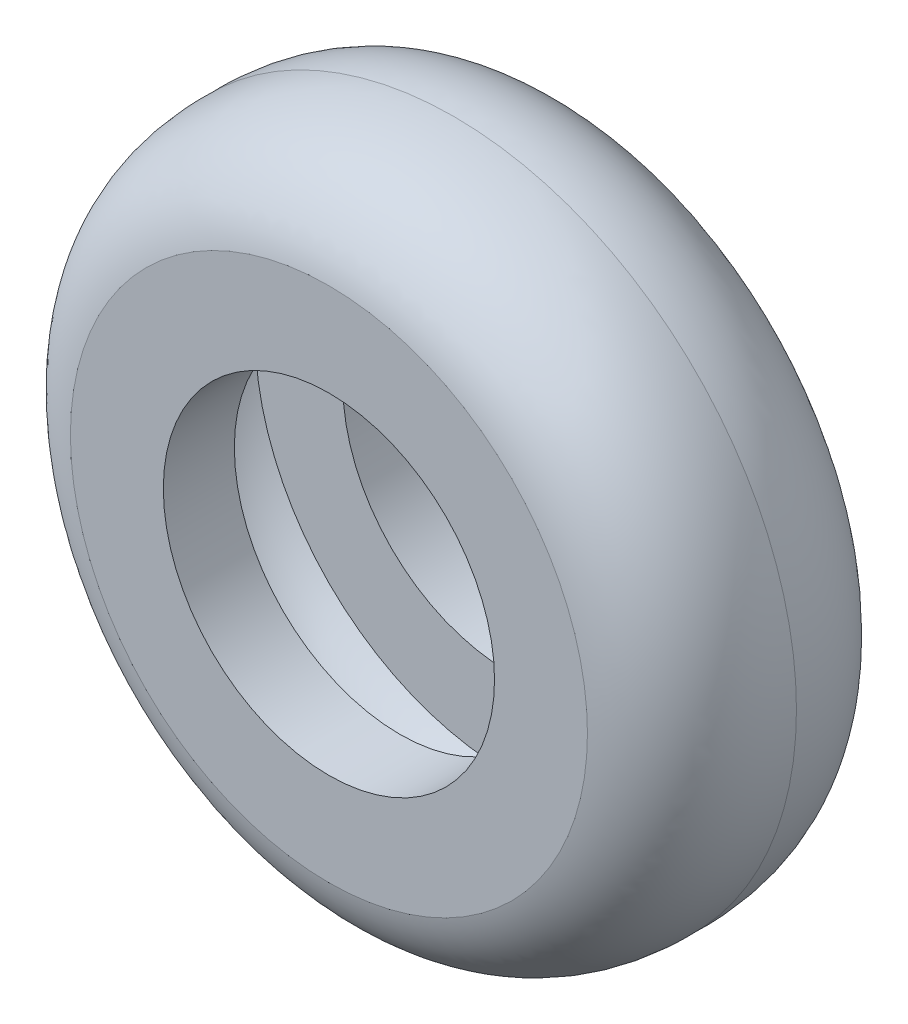
ISO-10303-21;
HEADER;
FILE_DESCRIPTION(('STEP AP214'),'2;1');
FILE_NAME('part.step','',(''),(''),'','','');
FILE_SCHEMA(('AUTOMOTIVE_DESIGN { 1 0 10303 214 1 1 1 1 }'));
ENDSEC;
DATA;
#1=APPLICATION_CONTEXT('core data for automotive mechanical design processes');
#2=APPLICATION_PROTOCOL_DEFINITION('international standard','automotive_design',2000,#1);
#3=PRODUCT_CONTEXT('',#1,'mechanical');
#4=PRODUCT('Part','Part','',(#3));
#5=PRODUCT_RELATED_PRODUCT_CATEGORY('part','',(#4));
#6=PRODUCT_DEFINITION_FORMATION('','',#4);
#7=PRODUCT_DEFINITION_CONTEXT('part definition',#1,'design');
#8=PRODUCT_DEFINITION('design','',#6,#7);
#9=PRODUCT_DEFINITION_SHAPE('','',#8);
#10=(LENGTH_UNIT() NAMED_UNIT(*) SI_UNIT(.MILLI.,.METRE.));
#11=(NAMED_UNIT(*) PLANE_ANGLE_UNIT() SI_UNIT($,.RADIAN.));
#12=(NAMED_UNIT(*) SI_UNIT($,.STERADIAN.) SOLID_ANGLE_UNIT());
#13=UNCERTAINTY_MEASURE_WITH_UNIT(LENGTH_MEASURE(1.E-05),#10,'distance_accuracy_value','');
#14=(GEOMETRIC_REPRESENTATION_CONTEXT(3) GLOBAL_UNCERTAINTY_ASSIGNED_CONTEXT((#13)) GLOBAL_UNIT_ASSIGNED_CONTEXT((#10,
#11,#12)) REPRESENTATION_CONTEXT('',''));
#15=CARTESIAN_POINT('',(0.,0.,0.));
#16=DIRECTION('',(0.,0.,1.));
#17=DIRECTION('',(1.,0.,0.));
#18=AXIS2_PLACEMENT_3D('',#15,#16,#17);
#19=CARTESIAN_POINT('',(0.,421.147902539184,-892.286236837064));
#20=DIRECTION('',(0.,0.,1.));
#21=DIRECTION('',(1.,0.,0.));
#22=AXIS2_PLACEMENT_3D('',#19,#20,#21);
#23=PLANE('',#22);
#24=CARTESIAN_POINT('',(0.,132.98798877851,-892.286236837064));
#25=DIRECTION('',(0.,0.,1.));
#26=DIRECTION('',(1.,0.,0.));
#27=AXIS2_PLACEMENT_3D('',#24,#25,#26);
#28=CIRCLE('',#27,256.802743969229);
#29=CARTESIAN_POINT('',(256.802743969229,132.98798877851,-892.286236837064));
#30=VERTEX_POINT('',#29);
#31=EDGE_CURVE('E10',#30,#30,#28,.T.);
#32=ORIENTED_EDGE('',*,*,#31,.T.);
#33=EDGE_LOOP('',(#32));
#34=FACE_BOUND('',#33,.T.);
#35=CARTESIAN_POINT('',(0.,132.98798877851,-892.286236837064));
#36=DIRECTION('',(0.,0.,1.));
#37=DIRECTION('',(1.,0.,0.));
#38=AXIS2_PLACEMENT_3D('',#35,#36,#37);
#39=CIRCLE('',#38,167.950603654191);
#40=CARTESIAN_POINT('',(167.950603654191,132.98798877851,-892.286236837064));
#41=VERTEX_POINT('',#40);
#42=EDGE_CURVE('E67',#41,#41,#39,.T.);
#43=ORIENTED_EDGE('',*,*,#42,.F.);
#44=EDGE_LOOP('',(#43));
#45=FACE_BOUND('',#44,.T.);
#46=ADVANCED_FACE('F36',(#34,#45),#23,.T.);
#47=CARTESIAN_POINT('',(0.,389.79073274774,-892.286236837064));
#48=CARTESIAN_POINT('',(0.,393.181771995535,-888.506836718797));
#49=CARTESIAN_POINT('',(0.,396.212928085959,-884.497045233481));
#50=CARTESIAN_POINT('',(0.,400.215371099895,-878.133911647205));
#51=CARTESIAN_POINT('',(0.,401.458146723589,-875.954372213838));
#52=CARTESIAN_POINT('',(0.,403.178604780385,-872.593065208419));
#53=CARTESIAN_POINT('',(0.,403.728096402363,-871.457268715738));
#54=CARTESIAN_POINT('',(0.,404.777418291793,-869.15388333575));
#55=CARTESIAN_POINT('',(0.,405.278342643676,-867.983306082393));
#56=CARTESIAN_POINT('',(0.,407.631212359789,-862.106032251005));
#57=CARTESIAN_POINT('',(0.,409.045700505197,-857.300538024455));
#58=CARTESIAN_POINT('',(0.,410.449908690192,-849.933279568193));
#59=CARTESIAN_POINT('',(0.,410.797778087832,-847.450888119799));
#60=CARTESIAN_POINT('',(0.,411.131957476601,-843.685719705866));
#61=CARTESIAN_POINT('',(0.,411.21204337434,-842.42372528359));
#62=CARTESIAN_POINT('',(0.,411.283958389052,-840.520048538366));
#63=CARTESIAN_POINT('',(0.,411.299859200463,-839.883680050669));
#64=CARTESIAN_POINT('',(0.,411.315382677275,-838.615227134721));
#65=CARTESIAN_POINT('',(0.,411.315051136174,-837.982157811478));
#66=CARTESIAN_POINT('',(0.,411.240114141058,-832.29482138344));
#67=CARTESIAN_POINT('',(0.,410.664006645543,-827.312256414976));
#68=CARTESIAN_POINT('',(0.,409.08672284422,-819.940367492152));
#69=CARTESIAN_POINT('',(0.,408.441705980661,-817.500121725374));
#70=CARTESIAN_POINT('',(0.,406.91776973329,-812.653072349593));
#71=CARTESIAN_POINT('',(0.,406.049450052239,-810.280141013201));
#72=CARTESIAN_POINT('',(0.,403.16178769661,-803.315547943799));
#73=CARTESIAN_POINT('',(0.,400.858605058216,-798.869326084806));
#74=CARTESIAN_POINT('',(0.,396.924563597812,-792.449518534422));
#75=CARTESIAN_POINT('',(0.,395.532942117777,-790.351376610094));
#76=CARTESIAN_POINT('',(0.,393.333229570429,-787.262621213914));
#77=CARTESIAN_POINT('',(0.,392.580772092283,-786.242198665072));
#78=CARTESIAN_POINT('',(0.,391.045359461912,-784.227603999844));
#79=CARTESIAN_POINT('',(0.,390.261814103764,-783.232558887897));
#80=CARTESIAN_POINT('',(0.,389.463155425916,-782.249204616643));
#81=B_SPLINE_CURVE_WITH_KNOTS('',3,(#47,#48,#49,#50,#51,#52,#53,#54,#55,#56,#57,#58,#59,#60,#61,
#62,#63,#64,#65,#66,#67,#68,#69,#70,#71,#72,#73,#74,#75,#76,#77,#78,#79,#80),.UNSPECIFIED.,.F.,
.F.,(4,2,2,2,2,2,2,2,2,2,2,2,2,2,2,2,4),(0.,0.124999999999989,0.187499999999983,
0.218749999999981,0.249999999999978,0.374999999999968,0.437499999999965,0.468749999999964,
0.484374999999964,0.499999999999964,0.624999999999974,0.687499999999979,0.749999999999984,
0.874999999999993,0.937499999999998,0.968749999999999,1.),.UNSPECIFIED.);
#82=CARTESIAN_POINT('',(0.,132.98798877851,-837.02783752733));
#83=DIRECTION('',(0.,0.,1.));
#84=AXIS1_PLACEMENT('',#82,#83);
#85=SURFACE_OF_REVOLUTION('',#81,#84);
#86=CARTESIAN_POINT('',(0.,132.98798877851,-782.249204616643));
#87=DIRECTION('',(0.,0.,1.));
#88=DIRECTION('',(1.,0.,0.));
#89=AXIS2_PLACEMENT_3D('',#86,#87,#88);
#90=CIRCLE('',#89,256.475166647405);
#91=CARTESIAN_POINT('',(256.475166647405,132.98798877851,-782.249204616643));
#92=VERTEX_POINT('',#91);
#93=EDGE_CURVE('E42',#92,#92,#90,.T.);
#94=ORIENTED_EDGE('',*,*,#93,.T.);
#95=EDGE_LOOP('',(#94));
#96=FACE_BOUND('',#95,.T.);
#97=ORIENTED_EDGE('',*,*,#31,.F.);
#98=EDGE_LOOP('',(#97));
#99=FACE_BOUND('',#98,.T.);
#100=ADVANCED_FACE('F104',(#96,#99),#85,.F.);
#101=CARTESIAN_POINT('',(0.,421.147902539184,-782.249204616643));
#102=DIRECTION('',(0.,0.,-1.));
#103=DIRECTION('',(-1.,0.,0.));
#104=AXIS2_PLACEMENT_3D('',#101,#102,#103);
#105=PLANE('',#104);
#106=CARTESIAN_POINT('',(0.,132.98798877851,-782.249204616643));
#107=DIRECTION('',(0.,0.,1.));
#108=DIRECTION('',(1.,0.,0.));
#109=AXIS2_PLACEMENT_3D('',#106,#107,#108);
#110=CIRCLE('',#109,167.950603654191);
#111=CARTESIAN_POINT('',(167.950603654191,132.98798877851,-782.249204616643));
#112=VERTEX_POINT('',#111);
#113=EDGE_CURVE('E46',#112,#112,#110,.T.);
#114=ORIENTED_EDGE('',*,*,#113,.T.);
#115=EDGE_LOOP('',(#114));
#116=FACE_BOUND('',#115,.T.);
#117=ORIENTED_EDGE('',*,*,#93,.F.);
#118=EDGE_LOOP('',(#117));
#119=FACE_BOUND('',#118,.T.);
#120=ADVANCED_FACE('F101',(#116,#119),#105,.T.);
#121=CARTESIAN_POINT('',(0.,132.98798877851,-837.02783752733));
#122=DIRECTION('',(0.,0.,1.));
#123=DIRECTION('',(1.,0.,0.));
#124=AXIS2_PLACEMENT_3D('',#121,#122,#123);
#125=CYLINDRICAL_SURFACE('',#124,167.950603654191);
#126=CARTESIAN_POINT('',(0.,132.98798877851,-710.223227247339));
#127=DIRECTION('',(0.,0.,1.));
#128=DIRECTION('',(1.,0.,0.));
#129=AXIS2_PLACEMENT_3D('',#126,#127,#128);
#130=CIRCLE('',#129,167.950603654191);
#131=CARTESIAN_POINT('',(167.950603654191,132.98798877851,-710.223227247339));
#132=VERTEX_POINT('',#131);
#133=EDGE_CURVE('E50',#132,#132,#130,.T.);
#134=ORIENTED_EDGE('',*,*,#133,.T.);
#135=EDGE_LOOP('',(#134));
#136=FACE_BOUND('',#135,.T.);
#137=ORIENTED_EDGE('',*,*,#113,.F.);
#138=EDGE_LOOP('',(#137));
#139=FACE_BOUND('',#138,.T.);
#140=ADVANCED_FACE('F97',(#136,#139),#125,.F.);
#141=CARTESIAN_POINT('',(0.,421.147902539184,-710.223227247339));
#142=DIRECTION('',(0.,0.,1.));
#143=DIRECTION('',(1.,0.,0.));
#144=AXIS2_PLACEMENT_3D('',#141,#142,#143);
#145=PLANE('',#144);
#146=CARTESIAN_POINT('',(0.,132.98798877851,-710.223227247339));
#147=DIRECTION('',(0.,0.,1.));
#148=DIRECTION('',(1.,0.,0.));
#149=AXIS2_PLACEMENT_3D('',#146,#147,#148);
#150=CIRCLE('',#149,262.18102313435);
#151=CARTESIAN_POINT('',(262.18102313435,132.98798877851,-710.223227247339));
#152=VERTEX_POINT('',#151);
#153=EDGE_CURVE('E55',#152,#152,#150,.T.);
#154=ORIENTED_EDGE('',*,*,#153,.T.);
#155=EDGE_LOOP('',(#154));
#156=FACE_BOUND('',#155,.T.);
#157=ORIENTED_EDGE('',*,*,#133,.F.);
#158=EDGE_LOOP('',(#157));
#159=FACE_BOUND('',#158,.T.);
#160=ADVANCED_FACE('F93',(#156,#159),#145,.T.);
#161=CARTESIAN_POINT('',(0.,395.169011912861,-710.223227247339));
#162=CARTESIAN_POINT('',(0.,396.029119807052,-710.406499959015));
#163=CARTESIAN_POINT('',(0.,396.889701554909,-710.588619589109));
#164=CARTESIAN_POINT('',(0.,398.600345098677,-710.978458235103));
#165=CARTESIAN_POINT('',(0.,399.451683248965,-711.183071353912));
#166=CARTESIAN_POINT('',(0.,401.993736422133,-711.82601743668));
#167=CARTESIAN_POINT('',(0.,403.67249536314,-712.293444483399));
#168=CARTESIAN_POINT('',(0.,408.660672692245,-713.812771548095));
#169=CARTESIAN_POINT('',(0.,411.922078990846,-714.981504799578));
#170=CARTESIAN_POINT('',(0.,418.313322896437,-717.639132241801));
#171=CARTESIAN_POINT('',(0.,421.443174385499,-719.127992651727));
#172=CARTESIAN_POINT('',(0.,426.034457305781,-721.613127654152));
#173=CARTESIAN_POINT('',(0.,427.547611513711,-722.483539379354));
#174=CARTESIAN_POINT('',(0.,429.79058582528,-723.854267794444));
#175=CARTESIAN_POINT('',(0.,430.533782624157,-724.322033462818));
#176=CARTESIAN_POINT('',(0.,432.011089514055,-725.279676510841));
#177=CARTESIAN_POINT('',(0.,432.746027021392,-725.770163185269));
#178=CARTESIAN_POINT('',(0.,439.275871959401,-730.255822565172));
#179=CARTESIAN_POINT('',(0.,444.549729121029,-734.788354562526));
#180=CARTESIAN_POINT('',(0.,451.701829224669,-742.367048757476));
#181=CARTESIAN_POINT('',(0.,453.958795238441,-745.023899929528));
#182=CARTESIAN_POINT('',(0.,456.620891738045,-748.508523175925));
#183=CARTESIAN_POINT('',(0.,457.145345802329,-749.213635744783));
#184=CARTESIAN_POINT('',(0.,458.178278334006,-750.640283108853));
#185=CARTESIAN_POINT('',(0.,458.686704494795,-751.361818212461));
#186=CARTESIAN_POINT('',(0.,460.179568095016,-753.538497923243));
#187=CARTESIAN_POINT('',(0.,461.134618771477,-755.009798791152));
#188=CARTESIAN_POINT('',(0.,465.716915432054,-762.463190523443));
#189=CARTESIAN_POINT('',(0.,468.768587891839,-768.734288257376));
#190=CARTESIAN_POINT('',(0.,471.905168539953,-776.913602641353));
#191=CARTESIAN_POINT('',(0.,472.498394959884,-778.566582636753));
#192=CARTESIAN_POINT('',(0.,473.618241555741,-781.905986942239));
#193=CARTESIAN_POINT('',(0.,474.141552051908,-783.582584377721));
#194=CARTESIAN_POINT('',(0.,475.606160554725,-788.626336122594));
#195=CARTESIAN_POINT('',(0.,476.443188671649,-792.009935209394));
#196=CARTESIAN_POINT('',(0.,478.57875490535,-802.217575572816));
#197=CARTESIAN_POINT('',(0.,479.503675513209,-809.098172252723));
#198=CARTESIAN_POINT('',(0.,480.264793910061,-819.51386617319));
#199=CARTESIAN_POINT('',(0.,480.413572685998,-823.001647259253));
#200=CARTESIAN_POINT('',(0.,480.49067340318,-828.25542947781));
#201=CARTESIAN_POINT('',(0.,480.491967323597,-830.011371346253));
#202=CARTESIAN_POINT('',(0.,480.447712016252,-833.520263964108));
#203=CARTESIAN_POINT('',(0.,480.402205554028,-835.27426388983));
#204=CARTESIAN_POINT('',(0.,480.334372735019,-837.027837527331));
#205=B_SPLINE_CURVE_WITH_KNOTS('',3,(#161,#162,#163,#164,#165,#166,#167,#168,#169,#170,#171,
#172,#173,#174,#175,#176,#177,#178,#179,#180,#181,#182,#183,#184,#185,#186,#187,#188,#189,#190,
#191,#192,#193,#194,#195,#196,#197,#198,#199,#200,#201,#202,#203,#204),.UNSPECIFIED.,.F.,.F.,(4,
2,2,2,2,2,2,2,2,2,2,2,2,2,2,2,2,2,2,2,2,4),(0.,0.0156250000000002,0.0312500000000004,
0.0625000000000012,0.125000000000003,0.187500000000005,0.218750000000006,0.234375000000007,
0.250000000000007,0.375000000000006,0.437500000000005,0.453125000000004,0.468750000000004,
0.500000000000002,0.624999999999995,0.656249999999994,0.687499999999994,0.749999999999994,
0.874999999999997,0.937499999999999,0.968749999999999,1.),.UNSPECIFIED.);
#206=CARTESIAN_POINT('',(0.,132.98798877851,-837.02783752733));
#207=DIRECTION('',(0.,0.,1.));
#208=AXIS1_PLACEMENT('',#206,#207);
#209=SURFACE_OF_REVOLUTION('',#205,#208);
#210=CARTESIAN_POINT('',(0.,132.98798877851,-837.02783752733));
#211=DIRECTION('',(0.,0.,1.));
#212=DIRECTION('',(1.,0.,0.));
#213=AXIS2_PLACEMENT_3D('',#210,#211,#212);
#214=CIRCLE('',#213,347.346383956509);
#215=CARTESIAN_POINT('',(347.346383956509,132.98798877851,-837.02783752733));
#216=VERTEX_POINT('',#215);
#217=EDGE_CURVE('E58',#216,#216,#214,.T.);
#218=ORIENTED_EDGE('',*,*,#217,.T.);
#219=EDGE_LOOP('',(#218));
#220=FACE_BOUND('',#219,.T.);
#221=ORIENTED_EDGE('',*,*,#153,.F.);
#222=EDGE_LOOP('',(#221));
#223=FACE_BOUND('',#222,.T.);
#224=ADVANCED_FACE('F88',(#220,#223),#209,.F.);
#225=CARTESIAN_POINT('',(0.,395.169011912861,-963.832447807322));
#226=CARTESIAN_POINT('',(0.,396.029119807052,-963.649175095646));
#227=CARTESIAN_POINT('',(0.,396.889701554909,-963.467055465551));
#228=CARTESIAN_POINT('',(0.,398.600345098677,-963.077216819558));
#229=CARTESIAN_POINT('',(0.,399.451683248965,-962.872603700749));
#230=CARTESIAN_POINT('',(0.,401.993736422133,-962.22965761798));
#231=CARTESIAN_POINT('',(0.,403.67249536314,-961.762230571261));
#232=CARTESIAN_POINT('',(0.,408.660672692245,-960.242903506565));
#233=CARTESIAN_POINT('',(0.,411.922078990846,-959.074170255083));
#234=CARTESIAN_POINT('',(0.,418.313322896436,-956.416542812859));
#235=CARTESIAN_POINT('',(0.,421.443174385499,-954.927682402934));
#236=CARTESIAN_POINT('',(0.,426.034457305781,-952.442547400509));
#237=CARTESIAN_POINT('',(0.,427.547611513711,-951.572135675308));
#238=CARTESIAN_POINT('',(0.,429.79058582528,-950.201407260216));
#239=CARTESIAN_POINT('',(0.,430.533782624157,-949.733641591842));
#240=CARTESIAN_POINT('',(0.,432.011089514054,-948.77599854382));
#241=CARTESIAN_POINT('',(0.,432.746027021392,-948.285511869392));
#242=CARTESIAN_POINT('',(0.,439.275871959401,-943.799852489489));
#243=CARTESIAN_POINT('',(0.,444.549729121029,-939.267320492134));
#244=CARTESIAN_POINT('',(0.,451.701829224669,-931.688626297185));
#245=CARTESIAN_POINT('',(0.,453.95879523844,-929.031775125133));
#246=CARTESIAN_POINT('',(0.,456.620891738045,-925.547151878737));
#247=CARTESIAN_POINT('',(0.,457.14534580233,-924.842039309879));
#248=CARTESIAN_POINT('',(0.,458.178278334006,-923.415391945808));
#249=CARTESIAN_POINT('',(0.,458.686704494795,-922.693856842199));
#250=CARTESIAN_POINT('',(0.,460.179568095016,-920.517177131418));
#251=CARTESIAN_POINT('',(0.,461.134618771477,-919.045876263509));
#252=CARTESIAN_POINT('',(0.,465.716915432054,-911.592484531218));
#253=CARTESIAN_POINT('',(0.,468.768587891838,-905.321386797285));
#254=CARTESIAN_POINT('',(0.,471.905168539953,-897.142072413309));
#255=CARTESIAN_POINT('',(0.,472.498394959884,-895.489092417908));
#256=CARTESIAN_POINT('',(0.,473.618241555741,-892.149688112422));
#257=CARTESIAN_POINT('',(0.,474.141552051908,-890.47309067694));
#258=CARTESIAN_POINT('',(0.,475.606160554725,-885.429338932067));
#259=CARTESIAN_POINT('',(0.,476.443188671649,-882.045739845268));
#260=CARTESIAN_POINT('',(0.,478.57875490535,-871.838099481844));
#261=CARTESIAN_POINT('',(0.,479.503675513209,-864.957502801938));
#262=CARTESIAN_POINT('',(0.,480.264793910061,-854.541808881471));
#263=CARTESIAN_POINT('',(0.,480.413572685998,-851.054027795408));
#264=CARTESIAN_POINT('',(0.,480.49067340318,-845.800245576851));
#265=CARTESIAN_POINT('',(0.,480.491967323598,-844.044303708408));
#266=CARTESIAN_POINT('',(0.,480.447712016252,-840.535411090552));
#267=CARTESIAN_POINT('',(0.,480.402205554028,-838.781411164831));
#268=CARTESIAN_POINT('',(0.,480.334372735019,-837.027837527331));
#269=B_SPLINE_CURVE_WITH_KNOTS('',3,(#225,#226,#227,#228,#229,#230,#231,#232,#233,#234,#235,
#236,#237,#238,#239,#240,#241,#242,#243,#244,#245,#246,#247,#248,#249,#250,#251,#252,#253,#254,
#255,#256,#257,#258,#259,#260,#261,#262,#263,#264,#265,#266,#267,#268),.UNSPECIFIED.,.F.,.F.,(4,
2,2,2,2,2,2,2,2,2,2,2,2,2,2,2,2,2,2,2,2,4),(0.,0.0156250000000012,0.0312500000000023,
0.0625000000000051,0.125000000000012,0.187500000000018,0.218750000000021,0.234375000000022,
0.250000000000023,0.375000000000024,0.437500000000025,0.453125000000024,0.468750000000023,
0.500000000000022,0.625000000000017,0.656250000000016,0.687500000000016,0.750000000000012,
0.875000000000006,0.937500000000003,0.968750000000002,1.),.UNSPECIFIED.);
#270=CARTESIAN_POINT('',(0.,132.98798877851,-837.02783752733));
#271=DIRECTION('',(0.,0.,1.));
#272=AXIS1_PLACEMENT('',#270,#271);
#273=SURFACE_OF_REVOLUTION('',#269,#272);
#274=ORIENTED_EDGE('',*,*,#217,.F.);
#275=EDGE_LOOP('',(#274));
#276=FACE_BOUND('',#275,.T.);
#277=CARTESIAN_POINT('',(0.,132.98798877851,-963.832447807322));
#278=DIRECTION('',(0.,0.,1.));
#279=DIRECTION('',(1.,0.,0.));
#280=AXIS2_PLACEMENT_3D('',#277,#278,#279);
#281=CIRCLE('',#280,262.18102313435);
#282=CARTESIAN_POINT('',(262.18102313435,132.98798877851,-963.832447807322));
#283=VERTEX_POINT('',#282);
#284=EDGE_CURVE('E61',#283,#283,#281,.T.);
#285=ORIENTED_EDGE('',*,*,#284,.T.);
#286=EDGE_LOOP('',(#285));
#287=FACE_BOUND('',#286,.T.);
#288=ADVANCED_FACE('F83',(#276,#287),#273,.T.);
#289=CARTESIAN_POINT('',(0.,421.147902539184,-963.832447807322));
#290=DIRECTION('',(0.,0.,1.));
#291=DIRECTION('',(1.,0.,0.));
#292=AXIS2_PLACEMENT_3D('',#289,#290,#291);
#293=PLANE('',#292);
#294=ORIENTED_EDGE('',*,*,#284,.F.);
#295=EDGE_LOOP('',(#294));
#296=FACE_BOUND('',#295,.T.);
#297=CARTESIAN_POINT('',(0.,132.98798877851,-963.832447807322));
#298=DIRECTION('',(0.,0.,1.));
#299=DIRECTION('',(1.,0.,0.));
#300=AXIS2_PLACEMENT_3D('',#297,#298,#299);
#301=CIRCLE('',#300,167.950603654191);
#302=CARTESIAN_POINT('',(167.950603654191,132.98798877851,-963.832447807322));
#303=VERTEX_POINT('',#302);
#304=EDGE_CURVE('E64',#303,#303,#301,.T.);
#305=ORIENTED_EDGE('',*,*,#304,.T.);
#306=EDGE_LOOP('',(#305));
#307=FACE_BOUND('',#306,.T.);
#308=ADVANCED_FACE('F87',(#296,#307),#293,.F.);
#309=CARTESIAN_POINT('',(0.,132.98798877851,-837.02783752733));
#310=DIRECTION('',(0.,0.,1.));
#311=DIRECTION('',(1.,0.,0.));
#312=AXIS2_PLACEMENT_3D('',#309,#310,#311);
#313=CYLINDRICAL_SURFACE('',#312,167.950603654191);
#314=ORIENTED_EDGE('',*,*,#42,.T.);
#315=EDGE_LOOP('',(#314));
#316=FACE_BOUND('',#315,.T.);
#317=ORIENTED_EDGE('',*,*,#304,.F.);
#318=EDGE_LOOP('',(#317));
#319=FACE_BOUND('',#318,.T.);
#320=ADVANCED_FACE('F189',(#316,#319),#313,.F.);
#321=CLOSED_SHELL('',(#46,#100,#120,#140,#160,#224,#288,#308,#320));
#322=CARTESIAN_POINT('',(0.,310.938592432701,-902.286236837064));
#323=DIRECTION('',(0.,0.,1.));
#324=DIRECTION('',(1.,0.,0.));
#325=AXIS2_PLACEMENT_3D('',#322,#323,#324);
#326=PLANE('',#325);
#327=CARTESIAN_POINT('',(0.,132.98798877851,-902.286236837064));
#328=DIRECTION('',(0.,0.,1.));
#329=DIRECTION('',(1.,0.,0.));
#330=AXIS2_PLACEMENT_3D('',#327,#328,#329);
#331=CIRCLE('',#330,261.127444083469);
#332=CARTESIAN_POINT('',(261.127444083469,132.98798877851,-902.286236837064));
#333=VERTEX_POINT('',#332);
#334=EDGE_CURVE('E70',#333,#333,#331,.T.);
#335=ORIENTED_EDGE('',*,*,#334,.F.);
#336=EDGE_LOOP('',(#335));
#337=FACE_BOUND('',#336,.T.);
#338=CARTESIAN_POINT('',(0.,132.98798877851,-902.286236837064));
#339=DIRECTION('',(0.,0.,1.));
#340=DIRECTION('',(1.,0.,0.));
#341=AXIS2_PLACEMENT_3D('',#338,#339,#340);
#342=CIRCLE('',#341,177.950603654191);
#343=CARTESIAN_POINT('',(177.950603654191,132.98798877851,-902.286236837064));
#344=VERTEX_POINT('',#343);
#345=EDGE_CURVE('E137',#344,#344,#342,.T.);
#346=ORIENTED_EDGE('',*,*,#345,.T.);
#347=EDGE_LOOP('',(#346));
#348=FACE_BOUND('',#347,.T.);
#349=ADVANCED_FACE('F179',(#337,#348),#326,.F.);
#350=CARTESIAN_POINT('',(0.,394.11543286198,-902.286236837064));
#351=CARTESIAN_POINT('',(0.,424.487255020984,-871.360516657951));
#352=CARTESIAN_POINT('',(0.,435.830196508854,-820.125420855317));
#353=CARTESIAN_POINT('',(0.,394.11543286198,-772.249204616643));
#354=B_SPLINE_CURVE_WITH_KNOTS('',3,(#350,#351,#352,#353),.UNSPECIFIED.,.F.,.F.,(4,4),(0.,1.),.UNSPECIFIED.);
#355=CARTESIAN_POINT('',(0.,132.98798877851,-837.02783752733));
#356=DIRECTION('',(0.,0.,1.));
#357=AXIS1_PLACEMENT('',#355,#356);
#358=SURFACE_OF_REVOLUTION('',#354,#357);
#359=CARTESIAN_POINT('',(0.,132.98798877851,-772.249204616643));
#360=DIRECTION('',(0.,0.,1.));
#361=DIRECTION('',(1.,0.,0.));
#362=AXIS2_PLACEMENT_3D('',#359,#360,#361);
#363=CIRCLE('',#362,261.127444083469);
#364=CARTESIAN_POINT('',(261.127444083469,132.98798877851,-772.249204616643));
#365=VERTEX_POINT('',#364);
#366=EDGE_CURVE('E116',#365,#365,#363,.T.);
#367=ORIENTED_EDGE('',*,*,#366,.F.);
#368=EDGE_LOOP('',(#367));
#369=FACE_BOUND('',#368,.T.);
#370=ORIENTED_EDGE('',*,*,#334,.T.);
#371=EDGE_LOOP('',(#370));
#372=FACE_BOUND('',#371,.T.);
#373=ADVANCED_FACE('F175',(#369,#372),#358,.T.);
#374=CARTESIAN_POINT('',(0.,394.11543286198,-772.249204616643));
#375=DIRECTION('',(0.,0.,-1.));
#376=DIRECTION('',(-1.,0.,0.));
#377=AXIS2_PLACEMENT_3D('',#374,#375,#376);
#378=PLANE('',#377);
#379=CARTESIAN_POINT('',(0.,132.98798877851,-772.249204616643));
#380=DIRECTION('',(0.,0.,1.));
#381=DIRECTION('',(1.,0.,0.));
#382=AXIS2_PLACEMENT_3D('',#379,#380,#381);
#383=CIRCLE('',#382,177.950603654191);
#384=CARTESIAN_POINT('',(177.950603654191,132.98798877851,-772.249204616643));
#385=VERTEX_POINT('',#384);
#386=EDGE_CURVE('E119',#385,#385,#383,.T.);
#387=ORIENTED_EDGE('',*,*,#386,.F.);
#388=EDGE_LOOP('',(#387));
#389=FACE_BOUND('',#388,.T.);
#390=ORIENTED_EDGE('',*,*,#366,.T.);
#391=EDGE_LOOP('',(#390));
#392=FACE_BOUND('',#391,.T.);
#393=ADVANCED_FACE('F171',(#389,#392),#378,.F.);
#394=CARTESIAN_POINT('',(0.,132.98798877851,-837.02783752733));
#395=DIRECTION('',(0.,0.,1.));
#396=DIRECTION('',(1.,0.,0.));
#397=AXIS2_PLACEMENT_3D('',#394,#395,#396);
#398=CYLINDRICAL_SURFACE('',#397,177.950603654191);
#399=CARTESIAN_POINT('',(0.,132.98798877851,-720.223227247339));
#400=DIRECTION('',(0.,0.,1.));
#401=DIRECTION('',(1.,0.,0.));
#402=AXIS2_PLACEMENT_3D('',#399,#400,#401);
#403=CIRCLE('',#402,177.950603654191);
#404=CARTESIAN_POINT('',(177.950603654191,132.98798877851,-720.223227247339));
#405=VERTEX_POINT('',#404);
#406=EDGE_CURVE('E122',#405,#405,#403,.T.);
#407=ORIENTED_EDGE('',*,*,#406,.F.);
#408=EDGE_LOOP('',(#407));
#409=FACE_BOUND('',#408,.T.);
#410=ORIENTED_EDGE('',*,*,#386,.T.);
#411=EDGE_LOOP('',(#410));
#412=FACE_BOUND('',#411,.T.);
#413=ADVANCED_FACE('F167',(#409,#412),#398,.T.);
#414=CARTESIAN_POINT('',(0.,310.938592432701,-720.223227247339));
#415=DIRECTION('',(0.,0.,1.));
#416=DIRECTION('',(1.,0.,0.));
#417=AXIS2_PLACEMENT_3D('',#414,#415,#416);
#418=PLANE('',#417);
#419=CARTESIAN_POINT('',(0.,132.98798877851,-720.223227247339));
#420=DIRECTION('',(0.,0.,1.));
#421=DIRECTION('',(1.,0.,0.));
#422=AXIS2_PLACEMENT_3D('',#419,#420,#421);
#423=CIRCLE('',#422,261.127444083469);
#424=CARTESIAN_POINT('',(261.127444083469,132.98798877851,-720.223227247339));
#425=VERTEX_POINT('',#424);
#426=EDGE_CURVE('E125',#425,#425,#423,.T.);
#427=ORIENTED_EDGE('',*,*,#426,.F.);
#428=EDGE_LOOP('',(#427));
#429=FACE_BOUND('',#428,.T.);
#430=ORIENTED_EDGE('',*,*,#406,.T.);
#431=EDGE_LOOP('',(#430));
#432=FACE_BOUND('',#431,.T.);
#433=ADVANCED_FACE('F163',(#429,#432),#418,.F.);
#434=CARTESIAN_POINT('',(0.,394.11543286198,-720.223227247339));
#435=CARTESIAN_POINT('',(0.,438.953083364869,-729.777281858777));
#436=CARTESIAN_POINT('',(0.,473.111648615023,-768.50839738212));
#437=CARTESIAN_POINT('',(0.,470.326513859632,-837.02783752733));
#438=B_SPLINE_CURVE_WITH_KNOTS('',3,(#434,#435,#436,#437),.UNSPECIFIED.,.F.,.F.,(4,4),(0.,1.),.UNSPECIFIED.);
#439=CARTESIAN_POINT('',(0.,132.98798877851,-837.02783752733));
#440=DIRECTION('',(0.,0.,1.));
#441=AXIS1_PLACEMENT('',#439,#440);
#442=SURFACE_OF_REVOLUTION('',#438,#441);
#443=CARTESIAN_POINT('',(0.,132.98798877851,-837.02783752733));
#444=DIRECTION('',(0.,0.,1.));
#445=DIRECTION('',(1.,0.,0.));
#446=AXIS2_PLACEMENT_3D('',#443,#444,#445);
#447=CIRCLE('',#446,337.338525081122);
#448=CARTESIAN_POINT('',(337.338525081122,132.98798877851,-837.02783752733));
#449=VERTEX_POINT('',#448);
#450=EDGE_CURVE('E128',#449,#449,#447,.T.);
#451=ORIENTED_EDGE('',*,*,#450,.F.);
#452=EDGE_LOOP('',(#451));
#453=FACE_BOUND('',#452,.T.);
#454=ORIENTED_EDGE('',*,*,#426,.T.);
#455=EDGE_LOOP('',(#454));
#456=FACE_BOUND('',#455,.T.);
#457=ADVANCED_FACE('F157',(#453,#456),#442,.T.);
#458=CARTESIAN_POINT('',(0.,394.11543286198,-953.832447807322));
#459=CARTESIAN_POINT('',(0.,438.953083364869,-944.278393195883));
#460=CARTESIAN_POINT('',(0.,473.111648615023,-905.547277672541));
#461=CARTESIAN_POINT('',(0.,470.326513859632,-837.02783752733));
#462=B_SPLINE_CURVE_WITH_KNOTS('',3,(#458,#459,#460,#461),.UNSPECIFIED.,.F.,.F.,(4,4),(0.,1.),.UNSPECIFIED.);
#463=CARTESIAN_POINT('',(0.,132.98798877851,-837.02783752733));
#464=DIRECTION('',(0.,0.,1.));
#465=AXIS1_PLACEMENT('',#463,#464);
#466=SURFACE_OF_REVOLUTION('',#462,#465);
#467=ORIENTED_EDGE('',*,*,#450,.T.);
#468=EDGE_LOOP('',(#467));
#469=FACE_BOUND('',#468,.T.);
#470=CARTESIAN_POINT('',(0.,132.98798877851,-953.832447807322));
#471=DIRECTION('',(0.,0.,1.));
#472=DIRECTION('',(1.,0.,0.));
#473=AXIS2_PLACEMENT_3D('',#470,#471,#472);
#474=CIRCLE('',#473,261.127444083469);
#475=CARTESIAN_POINT('',(261.127444083469,132.98798877851,-953.832447807322));
#476=VERTEX_POINT('',#475);
#477=EDGE_CURVE('E131',#476,#476,#474,.T.);
#478=ORIENTED_EDGE('',*,*,#477,.F.);
#479=EDGE_LOOP('',(#478));
#480=FACE_BOUND('',#479,.T.);
#481=ADVANCED_FACE('F152',(#469,#480),#466,.F.);
#482=CARTESIAN_POINT('',(0.,310.938592432701,-953.832447807322));
#483=DIRECTION('',(0.,0.,1.));
#484=DIRECTION('',(1.,0.,0.));
#485=AXIS2_PLACEMENT_3D('',#482,#483,#484);
#486=PLANE('',#485);
#487=ORIENTED_EDGE('',*,*,#477,.T.);
#488=EDGE_LOOP('',(#487));
#489=FACE_BOUND('',#488,.T.);
#490=CARTESIAN_POINT('',(0.,132.98798877851,-953.832447807322));
#491=DIRECTION('',(0.,0.,1.));
#492=DIRECTION('',(1.,0.,0.));
#493=AXIS2_PLACEMENT_3D('',#490,#491,#492);
#494=CIRCLE('',#493,177.950603654191);
#495=CARTESIAN_POINT('',(177.950603654191,132.98798877851,-953.832447807322));
#496=VERTEX_POINT('',#495);
#497=EDGE_CURVE('E134',#496,#496,#494,.T.);
#498=ORIENTED_EDGE('',*,*,#497,.F.);
#499=EDGE_LOOP('',(#498));
#500=FACE_BOUND('',#499,.T.);
#501=ADVANCED_FACE('F156',(#489,#500),#486,.T.);
#502=CARTESIAN_POINT('',(0.,132.98798877851,-837.02783752733));
#503=DIRECTION('',(0.,0.,1.));
#504=DIRECTION('',(1.,0.,0.));
#505=AXIS2_PLACEMENT_3D('',#502,#503,#504);
#506=CYLINDRICAL_SURFACE('',#505,177.950603654191);
#507=ORIENTED_EDGE('',*,*,#345,.F.);
#508=EDGE_LOOP('',(#507));
#509=FACE_BOUND('',#508,.T.);
#510=ORIENTED_EDGE('',*,*,#497,.T.);
#511=EDGE_LOOP('',(#510));
#512=FACE_BOUND('',#511,.T.);
#513=ADVANCED_FACE('F294',(#509,#512),#506,.T.);
#514=CLOSED_SHELL('',(#349,#373,#393,#413,#433,#457,#481,#501,#513));
#515=ORIENTED_CLOSED_SHELL('',*,#514,.T.);
#516=BREP_WITH_VOIDS('B2',#321,(#515));
#517=ADVANCED_BREP_SHAPE_REPRESENTATION('',(#18,#516),#14);
#518=SHAPE_DEFINITION_REPRESENTATION(#9,#517);
ENDSEC;
END-ISO-10303-21;
